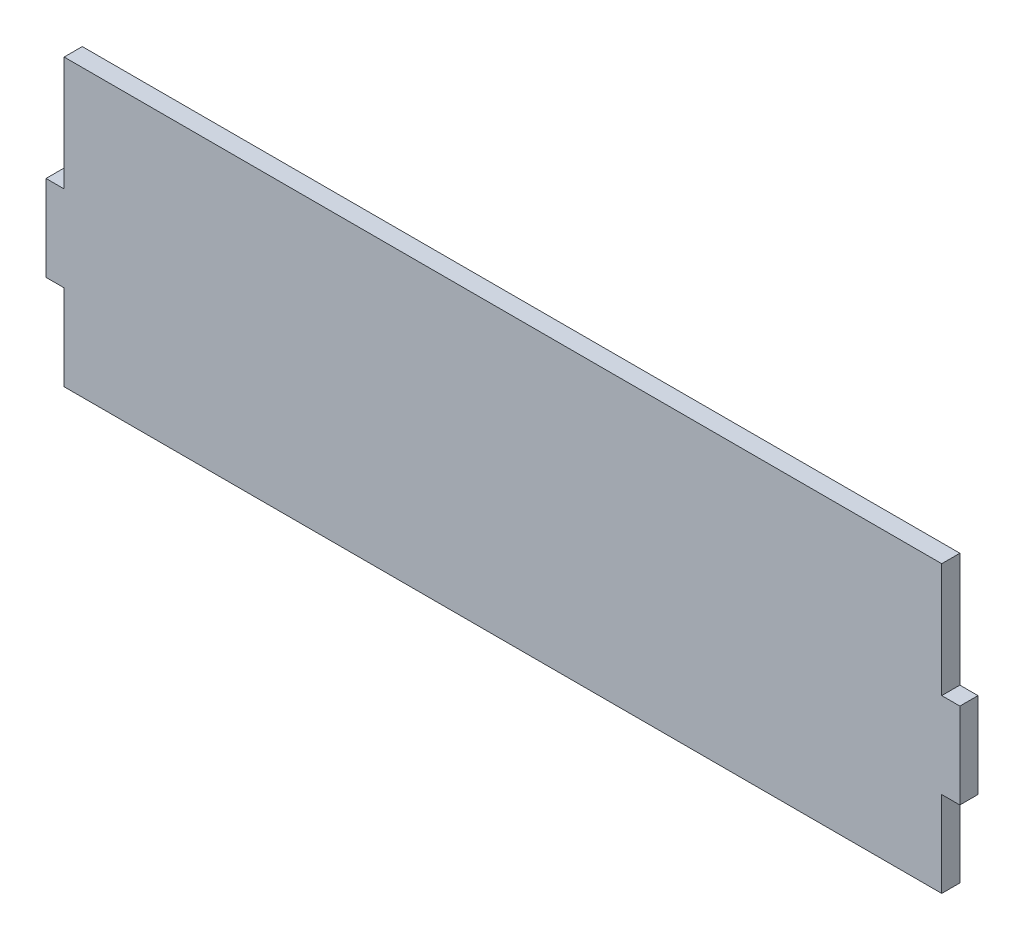
ISO-10303-21;
HEADER;
FILE_DESCRIPTION(('STEP AP214'),'2;1');
FILE_NAME('part.step','',(''),(''),'','','');
FILE_SCHEMA(('AUTOMOTIVE_DESIGN { 1 0 10303 214 1 1 1 1 }'));
ENDSEC;
DATA;
#1=APPLICATION_CONTEXT('core data for automotive mechanical design processes');
#2=APPLICATION_PROTOCOL_DEFINITION('international standard','automotive_design',2000,#1);
#3=PRODUCT_CONTEXT('',#1,'mechanical');
#4=PRODUCT('Part','Part','',(#3));
#5=PRODUCT_RELATED_PRODUCT_CATEGORY('part','',(#4));
#6=PRODUCT_DEFINITION_FORMATION('','',#4);
#7=PRODUCT_DEFINITION_CONTEXT('part definition',#1,'design');
#8=PRODUCT_DEFINITION('design','',#6,#7);
#9=PRODUCT_DEFINITION_SHAPE('','',#8);
#10=(LENGTH_UNIT() NAMED_UNIT(*) SI_UNIT(.MILLI.,.METRE.));
#11=(NAMED_UNIT(*) PLANE_ANGLE_UNIT() SI_UNIT($,.RADIAN.));
#12=(NAMED_UNIT(*) SI_UNIT($,.STERADIAN.) SOLID_ANGLE_UNIT());
#13=UNCERTAINTY_MEASURE_WITH_UNIT(LENGTH_MEASURE(1.E-05),#10,'distance_accuracy_value','');
#14=(GEOMETRIC_REPRESENTATION_CONTEXT(3) GLOBAL_UNCERTAINTY_ASSIGNED_CONTEXT((#13)) GLOBAL_UNIT_ASSIGNED_CONTEXT((#10,
#11,#12)) REPRESENTATION_CONTEXT('',''));
#15=CARTESIAN_POINT('',(0.,0.,0.));
#16=DIRECTION('',(0.,0.,1.));
#17=DIRECTION('',(1.,0.,0.));
#18=AXIS2_PLACEMENT_3D('',#15,#16,#17);
#19=CARTESIAN_POINT('',(-76.8249999999999,30.,3.175));
#20=DIRECTION('',(1.,0.,0.));
#21=DIRECTION('',(0.,1.,0.));
#22=AXIS2_PLACEMENT_3D('',#19,#20,#21);
#23=PLANE('',#22);
#24=DIRECTION('',(0.,-1.,0.));
#25=VECTOR('',#24,1.);
#26=CARTESIAN_POINT('',(-76.8249999999999,30.,0.));
#27=LINE('',#26,#25);
#28=CARTESIAN_POINT('',(-76.8249999999999,50.,0.));
#29=VERTEX_POINT('',#28);
#30=CARTESIAN_POINT('',(-76.8249999999999,30.,0.));
#31=VERTEX_POINT('',#30);
#32=EDGE_CURVE('E153',#29,#31,#27,.T.);
#33=ORIENTED_EDGE('',*,*,#32,.T.);
#34=DIRECTION('',(0.,0.,-1.));
#35=VECTOR('',#34,1.);
#36=CARTESIAN_POINT('',(-76.8249999999999,30.,3.175));
#37=LINE('',#36,#35);
#38=CARTESIAN_POINT('',(-76.8249999999999,30.,3.175));
#39=VERTEX_POINT('',#38);
#40=EDGE_CURVE('E11',#39,#31,#37,.T.);
#41=ORIENTED_EDGE('',*,*,#40,.F.);
#42=DIRECTION('',(0.,-1.,0.));
#43=VECTOR('',#42,1.);
#44=CARTESIAN_POINT('',(-76.8249999999999,30.,3.175));
#45=LINE('',#44,#43);
#46=CARTESIAN_POINT('',(-76.8249999999999,50.,3.175));
#47=VERTEX_POINT('',#46);
#48=EDGE_CURVE('E175',#47,#39,#45,.T.);
#49=ORIENTED_EDGE('',*,*,#48,.F.);
#50=DIRECTION('',(0.,0.,-1.));
#51=VECTOR('',#50,1.);
#52=CARTESIAN_POINT('',(-76.8249999999999,50.,3.175));
#53=LINE('',#52,#51);
#54=EDGE_CURVE('E149',#47,#29,#53,.T.);
#55=ORIENTED_EDGE('',*,*,#54,.T.);
#56=EDGE_LOOP('',(#33,#41,#49,#55));
#57=FACE_BOUND('',#56,.T.);
#58=ADVANCED_FACE('F33',(#57),#23,.F.);
#59=CARTESIAN_POINT('',(-79.9999999999999,30.,3.175));
#60=DIRECTION('',(0.,-1.,0.));
#61=DIRECTION('',(1.,0.,0.));
#62=AXIS2_PLACEMENT_3D('',#59,#60,#61);
#63=PLANE('',#62);
#64=DIRECTION('',(-1.,0.,0.));
#65=VECTOR('',#64,1.);
#66=CARTESIAN_POINT('',(-79.9999999999999,30.,0.));
#67=LINE('',#66,#65);
#68=CARTESIAN_POINT('',(-79.9999999999999,30.,0.));
#69=VERTEX_POINT('',#68);
#70=EDGE_CURVE('E156',#31,#69,#67,.T.);
#71=ORIENTED_EDGE('',*,*,#70,.T.);
#72=DIRECTION('',(0.,0.,-1.));
#73=VECTOR('',#72,1.);
#74=CARTESIAN_POINT('',(-79.9999999999999,30.,3.175));
#75=LINE('',#74,#73);
#76=CARTESIAN_POINT('',(-79.9999999999999,30.,3.175));
#77=VERTEX_POINT('',#76);
#78=EDGE_CURVE('E41',#77,#69,#75,.T.);
#79=ORIENTED_EDGE('',*,*,#78,.F.);
#80=DIRECTION('',(-1.,0.,0.));
#81=VECTOR('',#80,1.);
#82=CARTESIAN_POINT('',(-79.9999999999999,30.,3.175));
#83=LINE('',#82,#81);
#84=EDGE_CURVE('E104',#39,#77,#83,.T.);
#85=ORIENTED_EDGE('',*,*,#84,.F.);
#86=ORIENTED_EDGE('',*,*,#40,.T.);
#87=EDGE_LOOP('',(#71,#79,#85,#86));
#88=FACE_BOUND('',#87,.T.);
#89=ADVANCED_FACE('F253',(#88),#63,.F.);
#90=CARTESIAN_POINT('',(-79.9999999999999,15.,3.175));
#91=DIRECTION('',(1.,0.,0.));
#92=DIRECTION('',(0.,0.,-1.));
#93=AXIS2_PLACEMENT_3D('',#90,#91,#92);
#94=PLANE('',#93);
#95=DIRECTION('',(0.,-1.,0.));
#96=VECTOR('',#95,1.);
#97=CARTESIAN_POINT('',(-79.9999999999999,15.,0.));
#98=LINE('',#97,#96);
#99=CARTESIAN_POINT('',(-79.9999999999999,15.,0.));
#100=VERTEX_POINT('',#99);
#101=EDGE_CURVE('E158',#69,#100,#98,.T.);
#102=ORIENTED_EDGE('',*,*,#101,.T.);
#103=DIRECTION('',(0.,0.,-1.));
#104=VECTOR('',#103,1.);
#105=CARTESIAN_POINT('',(-79.9999999999999,15.,3.175));
#106=LINE('',#105,#104);
#107=CARTESIAN_POINT('',(-79.9999999999999,15.,3.175));
#108=VERTEX_POINT('',#107);
#109=EDGE_CURVE('E194',#108,#100,#106,.T.);
#110=ORIENTED_EDGE('',*,*,#109,.F.);
#111=DIRECTION('',(0.,-1.,0.));
#112=VECTOR('',#111,1.);
#113=CARTESIAN_POINT('',(-79.9999999999999,15.,3.175));
#114=LINE('',#113,#112);
#115=EDGE_CURVE('E202',#77,#108,#114,.T.);
#116=ORIENTED_EDGE('',*,*,#115,.F.);
#117=ORIENTED_EDGE('',*,*,#78,.T.);
#118=EDGE_LOOP('',(#102,#110,#116,#117));
#119=FACE_BOUND('',#118,.T.);
#120=ADVANCED_FACE('F200',(#119),#94,.F.);
#121=CARTESIAN_POINT('',(-76.8249999999999,15.,3.175));
#122=DIRECTION('',(0.,1.,0.));
#123=DIRECTION('',(0.,0.,1.));
#124=AXIS2_PLACEMENT_3D('',#121,#122,#123);
#125=PLANE('',#124);
#126=DIRECTION('',(1.,0.,0.));
#127=VECTOR('',#126,1.);
#128=CARTESIAN_POINT('',(-76.8249999999999,15.,0.));
#129=LINE('',#128,#127);
#130=CARTESIAN_POINT('',(-76.8249999999999,15.,0.));
#131=VERTEX_POINT('',#130);
#132=EDGE_CURVE('E160',#100,#131,#129,.T.);
#133=ORIENTED_EDGE('',*,*,#132,.T.);
#134=DIRECTION('',(0.,0.,-1.));
#135=VECTOR('',#134,1.);
#136=CARTESIAN_POINT('',(-76.8249999999999,15.,3.175));
#137=LINE('',#136,#135);
#138=CARTESIAN_POINT('',(-76.8249999999999,15.,3.175));
#139=VERTEX_POINT('',#138);
#140=EDGE_CURVE('E191',#139,#131,#137,.T.);
#141=ORIENTED_EDGE('',*,*,#140,.F.);
#142=DIRECTION('',(1.,0.,0.));
#143=VECTOR('',#142,1.);
#144=CARTESIAN_POINT('',(-76.8249999999999,15.,3.175));
#145=LINE('',#144,#143);
#146=EDGE_CURVE('E220',#108,#139,#145,.T.);
#147=ORIENTED_EDGE('',*,*,#146,.F.);
#148=ORIENTED_EDGE('',*,*,#109,.T.);
#149=EDGE_LOOP('',(#133,#141,#147,#148));
#150=FACE_BOUND('',#149,.T.);
#151=ADVANCED_FACE('F211',(#150),#125,.F.);
#152=CARTESIAN_POINT('',(-76.8249999999999,0.,3.175));
#153=DIRECTION('',(1.,0.,0.));
#154=DIRECTION('',(0.,0.,-1.));
#155=AXIS2_PLACEMENT_3D('',#152,#153,#154);
#156=PLANE('',#155);
#157=DIRECTION('',(0.,-1.,0.));
#158=VECTOR('',#157,1.);
#159=CARTESIAN_POINT('',(-76.8249999999999,0.,0.));
#160=LINE('',#159,#158);
#161=CARTESIAN_POINT('',(-76.8249999999999,0.,0.));
#162=VERTEX_POINT('',#161);
#163=EDGE_CURVE('E162',#131,#162,#160,.T.);
#164=ORIENTED_EDGE('',*,*,#163,.T.);
#165=DIRECTION('',(0.,0.,-1.));
#166=VECTOR('',#165,1.);
#167=CARTESIAN_POINT('',(-76.8249999999999,0.,3.175));
#168=LINE('',#167,#166);
#169=CARTESIAN_POINT('',(-76.8249999999999,0.,3.175));
#170=VERTEX_POINT('',#169);
#171=EDGE_CURVE('E188',#170,#162,#168,.T.);
#172=ORIENTED_EDGE('',*,*,#171,.F.);
#173=DIRECTION('',(0.,-1.,0.));
#174=VECTOR('',#173,1.);
#175=CARTESIAN_POINT('',(-76.8249999999999,0.,3.175));
#176=LINE('',#175,#174);
#177=EDGE_CURVE('E217',#139,#170,#176,.T.);
#178=ORIENTED_EDGE('',*,*,#177,.F.);
#179=ORIENTED_EDGE('',*,*,#140,.T.);
#180=EDGE_LOOP('',(#164,#172,#178,#179));
#181=FACE_BOUND('',#180,.T.);
#182=ADVANCED_FACE('F215',(#181),#156,.F.);
#183=CARTESIAN_POINT('',(-76.8249999999999,0.,3.175));
#184=DIRECTION('',(0.,1.,0.));
#185=DIRECTION('',(-1.,0.,0.));
#186=AXIS2_PLACEMENT_3D('',#183,#184,#185);
#187=PLANE('',#186);
#188=DIRECTION('',(1.,0.,0.));
#189=VECTOR('',#188,1.);
#190=CARTESIAN_POINT('',(-76.8249999999999,0.,0.));
#191=LINE('',#190,#189);
#192=CARTESIAN_POINT('',(76.825,0.,0.));
#193=VERTEX_POINT('',#192);
#194=EDGE_CURVE('E164',#162,#193,#191,.T.);
#195=ORIENTED_EDGE('',*,*,#194,.T.);
#196=DIRECTION('',(0.,0.,-1.));
#197=VECTOR('',#196,1.);
#198=CARTESIAN_POINT('',(76.825,0.,3.175));
#199=LINE('',#198,#197);
#200=CARTESIAN_POINT('',(76.825,0.,3.175));
#201=VERTEX_POINT('',#200);
#202=EDGE_CURVE('E185',#201,#193,#199,.T.);
#203=ORIENTED_EDGE('',*,*,#202,.F.);
#204=DIRECTION('',(1.,0.,0.));
#205=VECTOR('',#204,1.);
#206=CARTESIAN_POINT('',(-76.8249999999999,0.,3.175));
#207=LINE('',#206,#205);
#208=EDGE_CURVE('E219',#170,#201,#207,.T.);
#209=ORIENTED_EDGE('',*,*,#208,.F.);
#210=ORIENTED_EDGE('',*,*,#171,.T.);
#211=EDGE_LOOP('',(#195,#203,#209,#210));
#212=FACE_BOUND('',#211,.T.);
#213=ADVANCED_FACE('F266',(#212),#187,.F.);
#214=CARTESIAN_POINT('',(76.825,0.,3.175));
#215=DIRECTION('',(-1.,0.,0.));
#216=DIRECTION('',(0.,0.,1.));
#217=AXIS2_PLACEMENT_3D('',#214,#215,#216);
#218=PLANE('',#217);
#219=DIRECTION('',(0.,1.,0.));
#220=VECTOR('',#219,1.);
#221=CARTESIAN_POINT('',(76.825,0.,0.));
#222=LINE('',#221,#220);
#223=CARTESIAN_POINT('',(76.825,15.,0.));
#224=VERTEX_POINT('',#223);
#225=EDGE_CURVE('E166',#193,#224,#222,.T.);
#226=ORIENTED_EDGE('',*,*,#225,.T.);
#227=DIRECTION('',(0.,0.,-1.));
#228=VECTOR('',#227,1.);
#229=CARTESIAN_POINT('',(76.825,15.,3.175));
#230=LINE('',#229,#228);
#231=CARTESIAN_POINT('',(76.825,15.,3.175));
#232=VERTEX_POINT('',#231);
#233=EDGE_CURVE('E182',#232,#224,#230,.T.);
#234=ORIENTED_EDGE('',*,*,#233,.F.);
#235=DIRECTION('',(0.,1.,0.));
#236=VECTOR('',#235,1.);
#237=CARTESIAN_POINT('',(76.825,0.,3.175));
#238=LINE('',#237,#236);
#239=EDGE_CURVE('E222',#201,#232,#238,.T.);
#240=ORIENTED_EDGE('',*,*,#239,.F.);
#241=ORIENTED_EDGE('',*,*,#202,.T.);
#242=EDGE_LOOP('',(#226,#234,#240,#241));
#243=FACE_BOUND('',#242,.T.);
#244=ADVANCED_FACE('F269',(#243),#218,.F.);
#245=CARTESIAN_POINT('',(76.825,15.,3.175));
#246=DIRECTION('',(0.,1.,0.));
#247=DIRECTION('',(0.,0.,1.));
#248=AXIS2_PLACEMENT_3D('',#245,#246,#247);
#249=PLANE('',#248);
#250=DIRECTION('',(1.,0.,0.));
#251=VECTOR('',#250,1.);
#252=CARTESIAN_POINT('',(76.825,15.,0.));
#253=LINE('',#252,#251);
#254=CARTESIAN_POINT('',(80.,15.,0.));
#255=VERTEX_POINT('',#254);
#256=EDGE_CURVE('E168',#224,#255,#253,.T.);
#257=ORIENTED_EDGE('',*,*,#256,.T.);
#258=DIRECTION('',(0.,0.,-1.));
#259=VECTOR('',#258,1.);
#260=CARTESIAN_POINT('',(80.,15.,3.175));
#261=LINE('',#260,#259);
#262=CARTESIAN_POINT('',(80.,15.,3.175));
#263=VERTEX_POINT('',#262);
#264=EDGE_CURVE('E179',#263,#255,#261,.T.);
#265=ORIENTED_EDGE('',*,*,#264,.F.);
#266=DIRECTION('',(1.,0.,0.));
#267=VECTOR('',#266,1.);
#268=CARTESIAN_POINT('',(76.825,15.,3.175));
#269=LINE('',#268,#267);
#270=EDGE_CURVE('E228',#232,#263,#269,.T.);
#271=ORIENTED_EDGE('',*,*,#270,.F.);
#272=ORIENTED_EDGE('',*,*,#233,.T.);
#273=EDGE_LOOP('',(#257,#265,#271,#272));
#274=FACE_BOUND('',#273,.T.);
#275=ADVANCED_FACE('F234',(#274),#249,.F.);
#276=CARTESIAN_POINT('',(80.,15.,3.175));
#277=DIRECTION('',(-1.,0.,0.));
#278=DIRECTION('',(0.,0.,1.));
#279=AXIS2_PLACEMENT_3D('',#276,#277,#278);
#280=PLANE('',#279);
#281=DIRECTION('',(0.,1.,0.));
#282=VECTOR('',#281,1.);
#283=CARTESIAN_POINT('',(80.,15.,0.));
#284=LINE('',#283,#282);
#285=CARTESIAN_POINT('',(80.,30.,0.));
#286=VERTEX_POINT('',#285);
#287=EDGE_CURVE('E170',#255,#286,#284,.T.);
#288=ORIENTED_EDGE('',*,*,#287,.T.);
#289=DIRECTION('',(0.,0.,-1.));
#290=VECTOR('',#289,1.);
#291=CARTESIAN_POINT('',(80.,30.,3.175));
#292=LINE('',#291,#290);
#293=CARTESIAN_POINT('',(80.,30.,3.175));
#294=VERTEX_POINT('',#293);
#295=EDGE_CURVE('E144',#294,#286,#292,.T.);
#296=ORIENTED_EDGE('',*,*,#295,.F.);
#297=DIRECTION('',(0.,1.,0.));
#298=VECTOR('',#297,1.);
#299=CARTESIAN_POINT('',(80.,15.,3.175));
#300=LINE('',#299,#298);
#301=EDGE_CURVE('E135',#263,#294,#300,.T.);
#302=ORIENTED_EDGE('',*,*,#301,.F.);
#303=ORIENTED_EDGE('',*,*,#264,.T.);
#304=EDGE_LOOP('',(#288,#296,#302,#303));
#305=FACE_BOUND('',#304,.T.);
#306=ADVANCED_FACE('F238',(#305),#280,.F.);
#307=CARTESIAN_POINT('',(80.,30.,3.175));
#308=DIRECTION('',(0.,-1.,0.));
#309=DIRECTION('',(0.,0.,-1.));
#310=AXIS2_PLACEMENT_3D('',#307,#308,#309);
#311=PLANE('',#310);
#312=DIRECTION('',(-1.,0.,0.));
#313=VECTOR('',#312,1.);
#314=CARTESIAN_POINT('',(80.,30.,0.));
#315=LINE('',#314,#313);
#316=CARTESIAN_POINT('',(76.825,30.,0.));
#317=VERTEX_POINT('',#316);
#318=EDGE_CURVE('E143',#286,#317,#315,.T.);
#319=ORIENTED_EDGE('',*,*,#318,.T.);
#320=DIRECTION('',(0.,0.,-1.));
#321=VECTOR('',#320,1.);
#322=CARTESIAN_POINT('',(76.825,30.,3.175));
#323=LINE('',#322,#321);
#324=CARTESIAN_POINT('',(76.825,30.,3.175));
#325=VERTEX_POINT('',#324);
#326=EDGE_CURVE('E140',#325,#317,#323,.T.);
#327=ORIENTED_EDGE('',*,*,#326,.F.);
#328=DIRECTION('',(-1.,0.,0.));
#329=VECTOR('',#328,1.);
#330=CARTESIAN_POINT('',(80.,30.,3.175));
#331=LINE('',#330,#329);
#332=EDGE_CURVE('E129',#294,#325,#331,.T.);
#333=ORIENTED_EDGE('',*,*,#332,.F.);
#334=ORIENTED_EDGE('',*,*,#295,.T.);
#335=EDGE_LOOP('',(#319,#327,#333,#334));
#336=FACE_BOUND('',#335,.T.);
#337=ADVANCED_FACE('F141',(#336),#311,.F.);
#338=CARTESIAN_POINT('',(76.825,30.,3.175));
#339=DIRECTION('',(-1.,0.,0.));
#340=DIRECTION('',(0.,0.,1.));
#341=AXIS2_PLACEMENT_3D('',#338,#339,#340);
#342=PLANE('',#341);
#343=DIRECTION('',(0.,1.,0.));
#344=VECTOR('',#343,1.);
#345=CARTESIAN_POINT('',(76.825,30.,0.));
#346=LINE('',#345,#344);
#347=CARTESIAN_POINT('',(76.825,50.,0.));
#348=VERTEX_POINT('',#347);
#349=EDGE_CURVE('E90',#317,#348,#346,.T.);
#350=ORIENTED_EDGE('',*,*,#349,.T.);
#351=DIRECTION('',(0.,0.,-1.));
#352=VECTOR('',#351,1.);
#353=CARTESIAN_POINT('',(76.825,50.,3.175));
#354=LINE('',#353,#352);
#355=CARTESIAN_POINT('',(76.825,50.,3.175));
#356=VERTEX_POINT('',#355);
#357=EDGE_CURVE('E145',#356,#348,#354,.T.);
#358=ORIENTED_EDGE('',*,*,#357,.F.);
#359=DIRECTION('',(0.,1.,0.));
#360=VECTOR('',#359,1.);
#361=CARTESIAN_POINT('',(76.825,30.,3.175));
#362=LINE('',#361,#360);
#363=EDGE_CURVE('E133',#325,#356,#362,.T.);
#364=ORIENTED_EDGE('',*,*,#363,.F.);
#365=ORIENTED_EDGE('',*,*,#326,.T.);
#366=EDGE_LOOP('',(#350,#358,#364,#365));
#367=FACE_BOUND('',#366,.T.);
#368=ADVANCED_FACE('F147',(#367),#342,.F.);
#369=CARTESIAN_POINT('',(76.825,50.,3.175));
#370=DIRECTION('',(0.,-1.,0.));
#371=DIRECTION('',(1.,0.,0.));
#372=AXIS2_PLACEMENT_3D('',#369,#370,#371);
#373=PLANE('',#372);
#374=DIRECTION('',(-1.,0.,0.));
#375=VECTOR('',#374,1.);
#376=CARTESIAN_POINT('',(76.825,50.,0.));
#377=LINE('',#376,#375);
#378=EDGE_CURVE('E96',#348,#29,#377,.T.);
#379=ORIENTED_EDGE('',*,*,#378,.T.);
#380=ORIENTED_EDGE('',*,*,#54,.F.);
#381=DIRECTION('',(-1.,0.,0.));
#382=VECTOR('',#381,1.);
#383=CARTESIAN_POINT('',(76.825,50.,3.175));
#384=LINE('',#383,#382);
#385=EDGE_CURVE('E49',#356,#47,#384,.T.);
#386=ORIENTED_EDGE('',*,*,#385,.F.);
#387=ORIENTED_EDGE('',*,*,#357,.T.);
#388=EDGE_LOOP('',(#379,#380,#386,#387));
#389=FACE_BOUND('',#388,.T.);
#390=ADVANCED_FACE('F242',(#389),#373,.F.);
#391=CARTESIAN_POINT('',(0.,0.,3.175));
#392=DIRECTION('',(0.,0.,1.));
#393=DIRECTION('',(1.,0.,0.));
#394=AXIS2_PLACEMENT_3D('',#391,#392,#393);
#395=PLANE('',#394);
#396=ORIENTED_EDGE('',*,*,#48,.T.);
#397=ORIENTED_EDGE('',*,*,#84,.T.);
#398=ORIENTED_EDGE('',*,*,#115,.T.);
#399=ORIENTED_EDGE('',*,*,#146,.T.);
#400=ORIENTED_EDGE('',*,*,#177,.T.);
#401=ORIENTED_EDGE('',*,*,#208,.T.);
#402=ORIENTED_EDGE('',*,*,#239,.T.);
#403=ORIENTED_EDGE('',*,*,#270,.T.);
#404=ORIENTED_EDGE('',*,*,#301,.T.);
#405=ORIENTED_EDGE('',*,*,#332,.T.);
#406=ORIENTED_EDGE('',*,*,#363,.T.);
#407=ORIENTED_EDGE('',*,*,#385,.T.);
#408=EDGE_LOOP('',(#396,#397,#398,#399,#400,#401,#402,#403,#404,#405,#406,#407));
#409=FACE_BOUND('',#408,.T.);
#410=ADVANCED_FACE('F131',(#409),#395,.T.);
#411=CARTESIAN_POINT('',(0.,0.,0.));
#412=DIRECTION('',(0.,0.,1.));
#413=DIRECTION('',(1.,0.,0.));
#414=AXIS2_PLACEMENT_3D('',#411,#412,#413);
#415=PLANE('',#414);
#416=ORIENTED_EDGE('',*,*,#32,.F.);
#417=ORIENTED_EDGE('',*,*,#378,.F.);
#418=ORIENTED_EDGE('',*,*,#349,.F.);
#419=ORIENTED_EDGE('',*,*,#318,.F.);
#420=ORIENTED_EDGE('',*,*,#287,.F.);
#421=ORIENTED_EDGE('',*,*,#256,.F.);
#422=ORIENTED_EDGE('',*,*,#225,.F.);
#423=ORIENTED_EDGE('',*,*,#194,.F.);
#424=ORIENTED_EDGE('',*,*,#163,.F.);
#425=ORIENTED_EDGE('',*,*,#132,.F.);
#426=ORIENTED_EDGE('',*,*,#101,.F.);
#427=ORIENTED_EDGE('',*,*,#70,.F.);
#428=EDGE_LOOP('',(#416,#417,#418,#419,#420,#421,#422,#423,#424,#425,#426,#427));
#429=FACE_BOUND('',#428,.T.);
#430=ADVANCED_FACE('F206',(#429),#415,.F.);
#431=CLOSED_SHELL('',(#58,#89,#120,#151,#182,#213,#244,#275,#306,#337,#368,#390,#410,#430));
#432=MANIFOLD_SOLID_BREP('B2',#431);
#433=ADVANCED_BREP_SHAPE_REPRESENTATION('',(#18,#432),#14);
#434=SHAPE_DEFINITION_REPRESENTATION(#9,#433);
ENDSEC;
END-ISO-10303-21;
